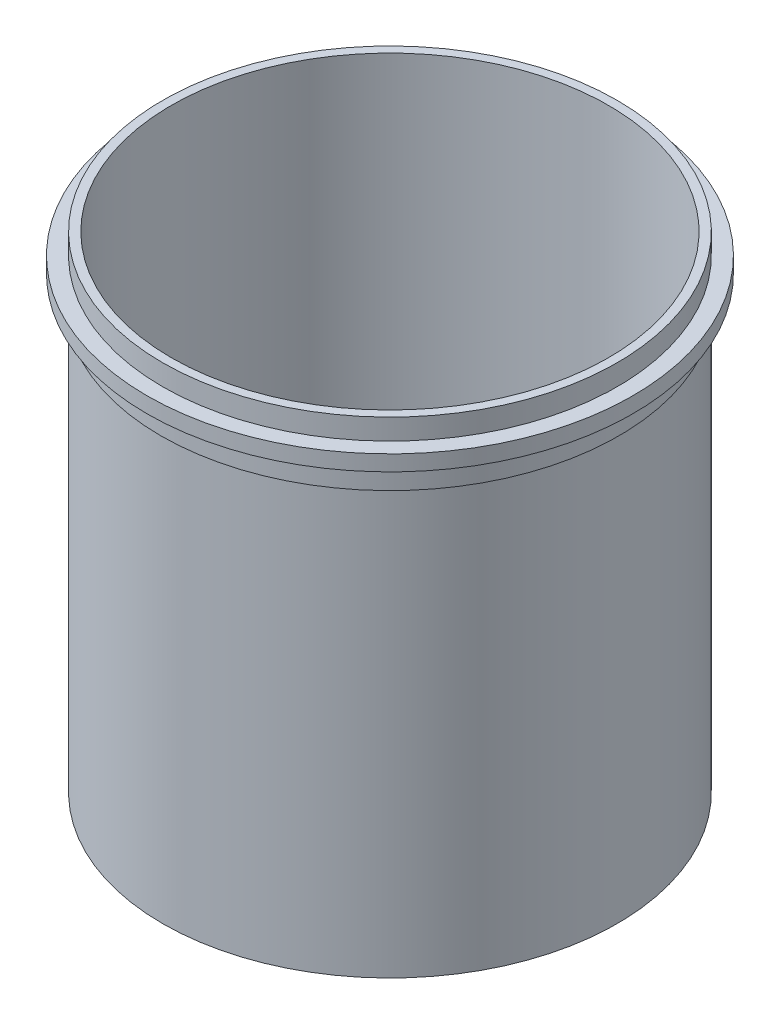
ISO-10303-21;
HEADER;
FILE_DESCRIPTION(('STEP AP214'),'2;1');
FILE_NAME('part.step','',(''),(''),'','','');
FILE_SCHEMA(('AUTOMOTIVE_DESIGN { 1 0 10303 214 1 1 1 1 }'));
ENDSEC;
DATA;
#1=APPLICATION_CONTEXT('core data for automotive mechanical design processes');
#2=APPLICATION_PROTOCOL_DEFINITION('international standard','automotive_design',2000,#1);
#3=PRODUCT_CONTEXT('',#1,'mechanical');
#4=PRODUCT('Part','Part','',(#3));
#5=PRODUCT_RELATED_PRODUCT_CATEGORY('part','',(#4));
#6=PRODUCT_DEFINITION_FORMATION('','',#4);
#7=PRODUCT_DEFINITION_CONTEXT('part definition',#1,'design');
#8=PRODUCT_DEFINITION('design','',#6,#7);
#9=PRODUCT_DEFINITION_SHAPE('','',#8);
#10=(LENGTH_UNIT() NAMED_UNIT(*) SI_UNIT(.MILLI.,.METRE.));
#11=(NAMED_UNIT(*) PLANE_ANGLE_UNIT() SI_UNIT($,.RADIAN.));
#12=(NAMED_UNIT(*) SI_UNIT($,.STERADIAN.) SOLID_ANGLE_UNIT());
#13=UNCERTAINTY_MEASURE_WITH_UNIT(LENGTH_MEASURE(1.E-05),#10,'distance_accuracy_value','');
#14=(GEOMETRIC_REPRESENTATION_CONTEXT(3) GLOBAL_UNCERTAINTY_ASSIGNED_CONTEXT((#13)) GLOBAL_UNIT_ASSIGNED_CONTEXT((#10,
#11,#12)) REPRESENTATION_CONTEXT('',''));
#15=CARTESIAN_POINT('',(0.,0.,0.));
#16=DIRECTION('',(0.,0.,1.));
#17=DIRECTION('',(1.,0.,0.));
#18=AXIS2_PLACEMENT_3D('',#15,#16,#17);
#19=CARTESIAN_POINT('',(0.,-21.,0.));
#20=DIRECTION('',(0.,1.,0.));
#21=DIRECTION('',(0.,0.,1.));
#22=AXIS2_PLACEMENT_3D('',#19,#20,#21);
#23=PLANE('',#22);
#24=CARTESIAN_POINT('',(0.,-21.,0.));
#25=DIRECTION('',(0.,1.,0.));
#26=DIRECTION('',(0.,0.,1.));
#27=AXIS2_PLACEMENT_3D('',#24,#25,#26);
#28=CIRCLE('',#27,140.);
#29=CARTESIAN_POINT('',(0.,-21.,140.));
#30=VERTEX_POINT('',#29);
#31=EDGE_CURVE('E95',#30,#30,#28,.T.);
#32=ORIENTED_EDGE('',*,*,#31,.F.);
#33=EDGE_LOOP('',(#32));
#34=FACE_BOUND('',#33,.T.);
#35=CARTESIAN_POINT('',(0.,-21.,0.));
#36=DIRECTION('',(0.,1.,0.));
#37=DIRECTION('',(0.,0.,1.));
#38=AXIS2_PLACEMENT_3D('',#35,#36,#37);
#39=CIRCLE('',#38,132.);
#40=CARTESIAN_POINT('',(0.,-21.,132.));
#41=VERTEX_POINT('',#40);
#42=EDGE_CURVE('E61',#41,#41,#39,.F.);
#43=ORIENTED_EDGE('',*,*,#42,.F.);
#44=EDGE_LOOP('',(#43));
#45=FACE_BOUND('',#44,.T.);
#46=ADVANCED_FACE('F52',(#34,#45),#23,.F.);
#47=CARTESIAN_POINT('',(0.,-280.,0.));
#48=DIRECTION('',(0.,1.,0.));
#49=DIRECTION('',(0.,0.,1.));
#50=AXIS2_PLACEMENT_3D('',#47,#48,#49);
#51=CYLINDRICAL_SURFACE('',#50,131.);
#52=CARTESIAN_POINT('',(0.,-36.,0.));
#53=DIRECTION('',(0.,-1.,0.));
#54=DIRECTION('',(0.,0.,-1.));
#55=AXIS2_PLACEMENT_3D('',#52,#53,#54);
#56=CIRCLE('',#55,131.);
#57=CARTESIAN_POINT('',(0.,-36.,-131.));
#58=VERTEX_POINT('',#57);
#59=EDGE_CURVE('E12',#58,#58,#56,.F.);
#60=ORIENTED_EDGE('',*,*,#59,.F.);
#61=EDGE_LOOP('',(#60));
#62=FACE_BOUND('',#61,.T.);
#63=CARTESIAN_POINT('',(0.,-280.,0.));
#64=DIRECTION('',(0.,1.,0.));
#65=DIRECTION('',(0.,0.,1.));
#66=AXIS2_PLACEMENT_3D('',#63,#64,#65);
#67=CIRCLE('',#66,131.);
#68=CARTESIAN_POINT('',(0.,-280.,131.));
#69=VERTEX_POINT('',#68);
#70=EDGE_CURVE('E83',#69,#69,#67,.T.);
#71=ORIENTED_EDGE('',*,*,#70,.T.);
#72=EDGE_LOOP('',(#71));
#73=FACE_BOUND('',#72,.T.);
#74=ADVANCED_FACE('F120',(#62,#73),#51,.T.);
#75=CARTESIAN_POINT('',(0.,-12.,0.));
#76=DIRECTION('',(0.,1.,0.));
#77=DIRECTION('',(0.,0.,1.));
#78=AXIS2_PLACEMENT_3D('',#75,#76,#77);
#79=CIRCLE('',#78,131.);
#80=CARTESIAN_POINT('',(0.,-12.,131.));
#81=VERTEX_POINT('',#80);
#82=EDGE_CURVE('E79',#81,#81,#79,.F.);
#83=ORIENTED_EDGE('',*,*,#82,.F.);
#84=EDGE_LOOP('',(#83));
#85=FACE_BOUND('',#84,.T.);
#86=CARTESIAN_POINT('',(0.,0.,0.));
#87=DIRECTION('',(0.,1.,0.));
#88=DIRECTION('',(0.,0.,1.));
#89=AXIS2_PLACEMENT_3D('',#86,#87,#88);
#90=CIRCLE('',#89,131.);
#91=CARTESIAN_POINT('',(0.,0.,131.));
#92=VERTEX_POINT('',#91);
#93=EDGE_CURVE('E84',#92,#92,#90,.T.);
#94=ORIENTED_EDGE('',*,*,#93,.F.);
#95=EDGE_LOOP('',(#94));
#96=FACE_BOUND('',#95,.T.);
#97=ADVANCED_FACE('F125',(#85,#96),#51,.T.);
#98=CARTESIAN_POINT('',(0.,-280.,0.));
#99=DIRECTION('',(0.,1.,0.));
#100=DIRECTION('',(0.,0.,1.));
#101=AXIS2_PLACEMENT_3D('',#98,#99,#100);
#102=PLANE('',#101);
#103=CARTESIAN_POINT('',(0.,-280.,0.));
#104=DIRECTION('',(0.,1.,0.));
#105=DIRECTION('',(0.,0.,1.));
#106=AXIS2_PLACEMENT_3D('',#103,#104,#105);
#107=CIRCLE('',#106,129.526539614169);
#108=CARTESIAN_POINT('',(0.,-280.,129.526539614169));
#109=VERTEX_POINT('',#108);
#110=EDGE_CURVE('E73',#109,#109,#107,.T.);
#111=ORIENTED_EDGE('',*,*,#110,.T.);
#112=EDGE_LOOP('',(#111));
#113=FACE_BOUND('',#112,.T.);
#114=ORIENTED_EDGE('',*,*,#70,.F.);
#115=EDGE_LOOP('',(#114));
#116=FACE_BOUND('',#115,.T.);
#117=ADVANCED_FACE('F143',(#113,#116),#102,.F.);
#118=CARTESIAN_POINT('',(0.,0.,0.));
#119=DIRECTION('',(0.,1.,0.));
#120=DIRECTION('',(0.,0.,1.));
#121=AXIS2_PLACEMENT_3D('',#118,#119,#120);
#122=PLANE('',#121);
#123=CARTESIAN_POINT('',(0.,0.,0.));
#124=DIRECTION('',(0.,1.,0.));
#125=DIRECTION('',(0.,0.,1.));
#126=AXIS2_PLACEMENT_3D('',#123,#124,#125);
#127=CIRCLE('',#126,126.);
#128=CARTESIAN_POINT('',(0.,0.,126.));
#129=VERTEX_POINT('',#128);
#130=EDGE_CURVE('E88',#129,#129,#127,.T.);
#131=ORIENTED_EDGE('',*,*,#130,.F.);
#132=EDGE_LOOP('',(#131));
#133=FACE_BOUND('',#132,.T.);
#134=ORIENTED_EDGE('',*,*,#93,.T.);
#135=EDGE_LOOP('',(#134));
#136=FACE_BOUND('',#135,.T.);
#137=ADVANCED_FACE('F141',(#133,#136),#122,.T.);
#138=CARTESIAN_POINT('',(0.,-280.,0.));
#139=DIRECTION('',(0.,1.,0.));
#140=DIRECTION('',(0.,0.,1.));
#141=AXIS2_PLACEMENT_3D('',#138,#139,#140);
#142=CYLINDRICAL_SURFACE('',#141,126.);
#143=CARTESIAN_POINT('',(0.,-259.999999999999,0.));
#144=DIRECTION('',(0.,1.,0.));
#145=DIRECTION('',(0.,0.,1.));
#146=AXIS2_PLACEMENT_3D('',#143,#144,#145);
#147=CIRCLE('',#146,126.);
#148=CARTESIAN_POINT('',(0.,-259.999999999999,126.));
#149=VERTEX_POINT('',#148);
#150=EDGE_CURVE('E67',#149,#149,#147,.F.);
#151=ORIENTED_EDGE('',*,*,#150,.T.);
#152=EDGE_LOOP('',(#151));
#153=FACE_BOUND('',#152,.T.);
#154=ORIENTED_EDGE('',*,*,#130,.T.);
#155=EDGE_LOOP('',(#154));
#156=FACE_BOUND('',#155,.T.);
#157=ADVANCED_FACE('F137',(#153,#156),#142,.F.);
#158=CARTESIAN_POINT('',(0.,-21.,0.));
#159=DIRECTION('',(0.,1.,0.));
#160=DIRECTION('',(0.,0.,1.));
#161=AXIS2_PLACEMENT_3D('',#158,#159,#160);
#162=CYLINDRICAL_SURFACE('',#161,140.);
#163=ORIENTED_EDGE('',*,*,#31,.T.);
#164=EDGE_LOOP('',(#163));
#165=FACE_BOUND('',#164,.T.);
#166=CARTESIAN_POINT('',(0.,-12.,0.));
#167=DIRECTION('',(0.,1.,0.));
#168=DIRECTION('',(0.,0.,1.));
#169=AXIS2_PLACEMENT_3D('',#166,#167,#168);
#170=CIRCLE('',#169,140.);
#171=CARTESIAN_POINT('',(0.,-12.,140.));
#172=VERTEX_POINT('',#171);
#173=EDGE_CURVE('E96',#172,#172,#170,.T.);
#174=ORIENTED_EDGE('',*,*,#173,.F.);
#175=EDGE_LOOP('',(#174));
#176=FACE_BOUND('',#175,.T.);
#177=ADVANCED_FACE('F133',(#165,#176),#162,.T.);
#178=CARTESIAN_POINT('',(0.,-12.,0.));
#179=DIRECTION('',(0.,1.,0.));
#180=DIRECTION('',(0.,0.,1.));
#181=AXIS2_PLACEMENT_3D('',#178,#179,#180);
#182=PLANE('',#181);
#183=ORIENTED_EDGE('',*,*,#82,.T.);
#184=EDGE_LOOP('',(#183));
#185=FACE_BOUND('',#184,.T.);
#186=ORIENTED_EDGE('',*,*,#173,.T.);
#187=EDGE_LOOP('',(#186));
#188=FACE_BOUND('',#187,.T.);
#189=ADVANCED_FACE('F130',(#185,#188),#182,.T.);
#190=CARTESIAN_POINT('',(0.,-280.,0.));
#191=DIRECTION('',(0.,-1.,0.));
#192=DIRECTION('',(0.,0.,-1.));
#193=AXIS2_PLACEMENT_3D('',#190,#191,#192);
#194=CONICAL_SURFACE('',#193,129.526539614169,0.174532925199428);
#195=ORIENTED_EDGE('',*,*,#150,.F.);
#196=EDGE_LOOP('',(#195));
#197=FACE_BOUND('',#196,.T.);
#198=ORIENTED_EDGE('',*,*,#110,.F.);
#199=EDGE_LOOP('',(#198));
#200=FACE_BOUND('',#199,.T.);
#201=ADVANCED_FACE('F55',(#197,#200),#194,.F.);
#202=CARTESIAN_POINT('',(0.,-36.,0.));
#203=DIRECTION('',(0.,-1.,0.));
#204=DIRECTION('',(0.,0.,-1.));
#205=AXIS2_PLACEMENT_3D('',#202,#203,#204);
#206=PLANE('',#205);
#207=CARTESIAN_POINT('',(0.,-36.,0.));
#208=DIRECTION('',(0.,-1.,0.));
#209=DIRECTION('',(0.,0.,-1.));
#210=AXIS2_PLACEMENT_3D('',#207,#208,#209);
#211=CIRCLE('',#210,132.);
#212=CARTESIAN_POINT('',(0.,-36.,-132.));
#213=VERTEX_POINT('',#212);
#214=EDGE_CURVE('E100',#213,#213,#211,.T.);
#215=ORIENTED_EDGE('',*,*,#214,.T.);
#216=EDGE_LOOP('',(#215));
#217=FACE_BOUND('',#216,.T.);
#218=ORIENTED_EDGE('',*,*,#59,.T.);
#219=EDGE_LOOP('',(#218));
#220=FACE_BOUND('',#219,.T.);
#221=ADVANCED_FACE('F109',(#217,#220),#206,.T.);
#222=CARTESIAN_POINT('',(0.,-36.,0.));
#223=DIRECTION('',(0.,1.,0.));
#224=DIRECTION('',(0.,0.,1.));
#225=AXIS2_PLACEMENT_3D('',#222,#223,#224);
#226=CYLINDRICAL_SURFACE('',#225,132.);
#227=ORIENTED_EDGE('',*,*,#214,.F.);
#228=EDGE_LOOP('',(#227));
#229=FACE_BOUND('',#228,.T.);
#230=ORIENTED_EDGE('',*,*,#42,.T.);
#231=EDGE_LOOP('',(#230));
#232=FACE_BOUND('',#231,.T.);
#233=ADVANCED_FACE('F111',(#229,#232),#226,.T.);
#234=CLOSED_SHELL('',(#46,#74,#97,#117,#137,#157,#177,#189,#201,#221,#233));
#235=MANIFOLD_SOLID_BREP('B2',#234);
#236=ADVANCED_BREP_SHAPE_REPRESENTATION('',(#18,#235),#14);
#237=SHAPE_DEFINITION_REPRESENTATION(#9,#236);
ENDSEC;
END-ISO-10303-21;
